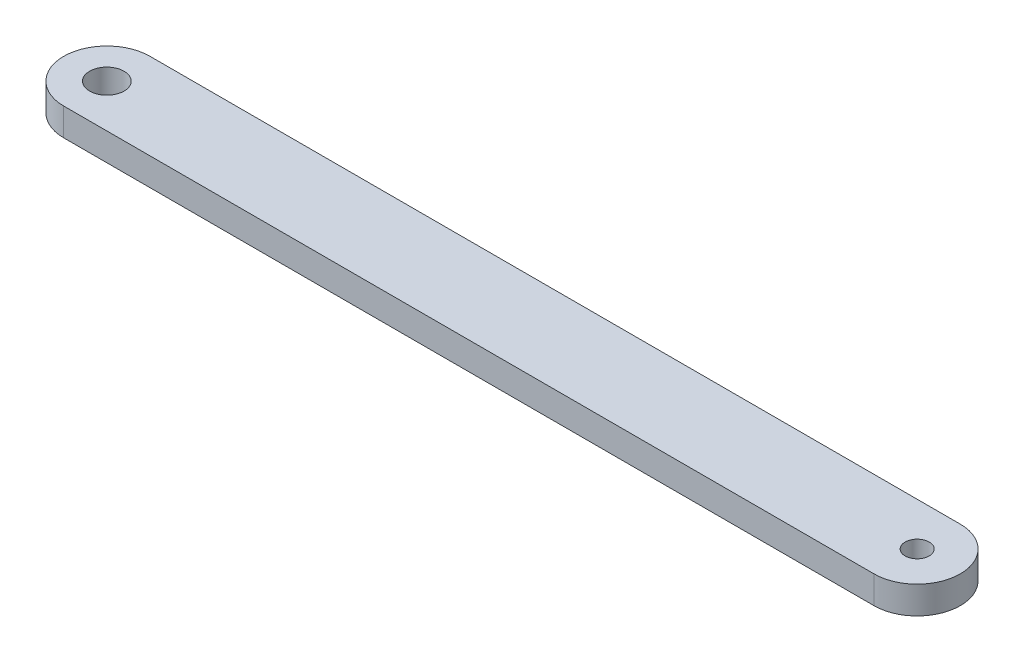
ISO-10303-21;
HEADER;
FILE_DESCRIPTION(('STEP AP214'),'2;1');
FILE_NAME('part.step','',(''),(''),'','','');
FILE_SCHEMA(('AUTOMOTIVE_DESIGN { 1 0 10303 214 1 1 1 1 }'));
ENDSEC;
DATA;
#1=APPLICATION_CONTEXT('core data for automotive mechanical design processes');
#2=APPLICATION_PROTOCOL_DEFINITION('international standard','automotive_design',2000,#1);
#3=PRODUCT_CONTEXT('',#1,'mechanical');
#4=PRODUCT('Part','Part','',(#3));
#5=PRODUCT_RELATED_PRODUCT_CATEGORY('part','',(#4));
#6=PRODUCT_DEFINITION_FORMATION('','',#4);
#7=PRODUCT_DEFINITION_CONTEXT('part definition',#1,'design');
#8=PRODUCT_DEFINITION('design','',#6,#7);
#9=PRODUCT_DEFINITION_SHAPE('','',#8);
#10=(LENGTH_UNIT() NAMED_UNIT(*) SI_UNIT(.MILLI.,.METRE.));
#11=(NAMED_UNIT(*) PLANE_ANGLE_UNIT() SI_UNIT($,.RADIAN.));
#12=(NAMED_UNIT(*) SI_UNIT($,.STERADIAN.) SOLID_ANGLE_UNIT());
#13=UNCERTAINTY_MEASURE_WITH_UNIT(LENGTH_MEASURE(1.E-05),#10,'distance_accuracy_value','');
#14=(GEOMETRIC_REPRESENTATION_CONTEXT(3) GLOBAL_UNCERTAINTY_ASSIGNED_CONTEXT((#13)) GLOBAL_UNIT_ASSIGNED_CONTEXT((#10,
#11,#12)) REPRESENTATION_CONTEXT('',''));
#15=CARTESIAN_POINT('',(0.,0.,0.));
#16=DIRECTION('',(0.,0.,1.));
#17=DIRECTION('',(1.,0.,0.));
#18=AXIS2_PLACEMENT_3D('',#15,#16,#17);
#19=CARTESIAN_POINT('',(0.,1.6,0.));
#20=DIRECTION('',(0.,1.,0.));
#21=DIRECTION('',(0.,0.,1.));
#22=AXIS2_PLACEMENT_3D('',#19,#20,#21);
#23=PLANE('',#22);
#24=CARTESIAN_POINT('',(0.,1.6,0.));
#25=DIRECTION('',(0.,1.,0.));
#26=DIRECTION('',(0.,0.,1.));
#27=AXIS2_PLACEMENT_3D('',#24,#25,#26);
#28=CIRCLE('',#27,1.);
#29=CARTESIAN_POINT('',(0.,1.6,1.));
#30=VERTEX_POINT('',#29);
#31=EDGE_CURVE('E106',#30,#30,#28,.T.);
#32=ORIENTED_EDGE('',*,*,#31,.F.);
#33=EDGE_LOOP('',(#32));
#34=FACE_BOUND('',#33,.T.);
#35=CARTESIAN_POINT('',(0.,1.6,0.));
#36=DIRECTION('',(0.,1.,0.));
#37=DIRECTION('',(0.,0.,1.));
#38=AXIS2_PLACEMENT_3D('',#35,#36,#37);
#39=CIRCLE('',#38,2.5);
#40=CARTESIAN_POINT('',(0.,1.6,-2.5));
#41=VERTEX_POINT('',#40);
#42=CARTESIAN_POINT('',(0.,1.6,2.5));
#43=VERTEX_POINT('',#42);
#44=EDGE_CURVE('E91',#41,#43,#39,.T.);
#45=ORIENTED_EDGE('',*,*,#44,.T.);
#46=DIRECTION('',(1.,0.,0.));
#47=VECTOR('',#46,1.);
#48=CARTESIAN_POINT('',(0.,1.6,2.5));
#49=LINE('',#48,#47);
#50=CARTESIAN_POINT('',(47.,1.6,2.5));
#51=VERTEX_POINT('',#50);
#52=EDGE_CURVE('E86',#43,#51,#49,.T.);
#53=ORIENTED_EDGE('',*,*,#52,.T.);
#54=CARTESIAN_POINT('',(47.,1.6,0.));
#55=DIRECTION('',(0.,1.,0.));
#56=DIRECTION('',(0.,0.,1.));
#57=AXIS2_PLACEMENT_3D('',#54,#55,#56);
#58=CIRCLE('',#57,2.5);
#59=CARTESIAN_POINT('',(47.,1.6,-2.5));
#60=VERTEX_POINT('',#59);
#61=EDGE_CURVE('E89',#51,#60,#58,.T.);
#62=ORIENTED_EDGE('',*,*,#61,.T.);
#63=DIRECTION('',(-1.,0.,0.));
#64=VECTOR('',#63,1.);
#65=CARTESIAN_POINT('',(0.,1.6,-2.5));
#66=LINE('',#65,#64);
#67=EDGE_CURVE('E56',#60,#41,#66,.T.);
#68=ORIENTED_EDGE('',*,*,#67,.T.);
#69=EDGE_LOOP('',(#45,#53,#62,#68));
#70=FACE_BOUND('',#69,.T.);
#71=CARTESIAN_POINT('',(47.,1.6,0.));
#72=DIRECTION('',(0.,1.,0.));
#73=DIRECTION('',(0.,0.,1.));
#74=AXIS2_PLACEMENT_3D('',#71,#72,#73);
#75=CIRCLE('',#74,0.700000000000001);
#76=CARTESIAN_POINT('',(47.,1.6,0.700000000000001));
#77=VERTEX_POINT('',#76);
#78=EDGE_CURVE('E121',#77,#77,#75,.T.);
#79=ORIENTED_EDGE('',*,*,#78,.F.);
#80=EDGE_LOOP('',(#79));
#81=FACE_BOUND('',#80,.T.);
#82=ADVANCED_FACE('F39',(#34,#70,#81),#23,.T.);
#83=CARTESIAN_POINT('',(0.,0.,0.));
#84=DIRECTION('',(0.,1.,0.));
#85=DIRECTION('',(0.,0.,1.));
#86=AXIS2_PLACEMENT_3D('',#83,#84,#85);
#87=PLANE('',#86);
#88=CARTESIAN_POINT('',(0.,0.,0.));
#89=DIRECTION('',(0.,1.,0.));
#90=DIRECTION('',(0.,0.,1.));
#91=AXIS2_PLACEMENT_3D('',#88,#89,#90);
#92=CIRCLE('',#91,2.5);
#93=CARTESIAN_POINT('',(0.,0.,-2.5));
#94=VERTEX_POINT('',#93);
#95=CARTESIAN_POINT('',(0.,0.,2.5));
#96=VERTEX_POINT('',#95);
#97=EDGE_CURVE('E103',#94,#96,#92,.T.);
#98=ORIENTED_EDGE('',*,*,#97,.F.);
#99=DIRECTION('',(-1.,0.,0.));
#100=VECTOR('',#99,1.);
#101=CARTESIAN_POINT('',(0.,0.,-2.5));
#102=LINE('',#101,#100);
#103=CARTESIAN_POINT('',(47.,0.,-2.5));
#104=VERTEX_POINT('',#103);
#105=EDGE_CURVE('E79',#104,#94,#102,.T.);
#106=ORIENTED_EDGE('',*,*,#105,.F.);
#107=CARTESIAN_POINT('',(47.,0.,0.));
#108=DIRECTION('',(0.,1.,0.));
#109=DIRECTION('',(0.,0.,1.));
#110=AXIS2_PLACEMENT_3D('',#107,#108,#109);
#111=CIRCLE('',#110,2.5);
#112=CARTESIAN_POINT('',(47.,0.,2.5));
#113=VERTEX_POINT('',#112);
#114=EDGE_CURVE('E73',#113,#104,#111,.T.);
#115=ORIENTED_EDGE('',*,*,#114,.F.);
#116=DIRECTION('',(1.,0.,0.));
#117=VECTOR('',#116,1.);
#118=CARTESIAN_POINT('',(0.,0.,2.5));
#119=LINE('',#118,#117);
#120=EDGE_CURVE('E95',#96,#113,#119,.T.);
#121=ORIENTED_EDGE('',*,*,#120,.F.);
#122=EDGE_LOOP('',(#98,#106,#115,#121));
#123=FACE_BOUND('',#122,.T.);
#124=CARTESIAN_POINT('',(0.,0.,0.));
#125=DIRECTION('',(0.,1.,0.));
#126=DIRECTION('',(0.,0.,1.));
#127=AXIS2_PLACEMENT_3D('',#124,#125,#126);
#128=CIRCLE('',#127,1.);
#129=CARTESIAN_POINT('',(0.,0.,1.));
#130=VERTEX_POINT('',#129);
#131=EDGE_CURVE('E118',#130,#130,#128,.T.);
#132=ORIENTED_EDGE('',*,*,#131,.T.);
#133=EDGE_LOOP('',(#132));
#134=FACE_BOUND('',#133,.T.);
#135=CARTESIAN_POINT('',(47.,0.,0.));
#136=DIRECTION('',(0.,1.,0.));
#137=DIRECTION('',(0.,0.,1.));
#138=AXIS2_PLACEMENT_3D('',#135,#136,#137);
#139=CIRCLE('',#138,0.700000000000001);
#140=CARTESIAN_POINT('',(47.,0.,0.700000000000001));
#141=VERTEX_POINT('',#140);
#142=EDGE_CURVE('E124',#141,#141,#139,.T.);
#143=ORIENTED_EDGE('',*,*,#142,.T.);
#144=EDGE_LOOP('',(#143));
#145=FACE_BOUND('',#144,.T.);
#146=ADVANCED_FACE('F114',(#123,#134,#145),#87,.F.);
#147=CARTESIAN_POINT('',(0.,1.6,0.));
#148=DIRECTION('',(0.,-1.,0.));
#149=DIRECTION('',(0.,0.,-1.));
#150=AXIS2_PLACEMENT_3D('',#147,#148,#149);
#151=CYLINDRICAL_SURFACE('',#150,2.5);
#152=ORIENTED_EDGE('',*,*,#97,.T.);
#153=DIRECTION('',(0.,-1.,0.));
#154=VECTOR('',#153,1.);
#155=CARTESIAN_POINT('',(0.,1.6,2.5));
#156=LINE('',#155,#154);
#157=EDGE_CURVE('E11',#43,#96,#156,.T.);
#158=ORIENTED_EDGE('',*,*,#157,.F.);
#159=ORIENTED_EDGE('',*,*,#44,.F.);
#160=DIRECTION('',(0.,-1.,0.));
#161=VECTOR('',#160,1.);
#162=CARTESIAN_POINT('',(0.,1.6,-2.5));
#163=LINE('',#162,#161);
#164=EDGE_CURVE('E99',#41,#94,#163,.T.);
#165=ORIENTED_EDGE('',*,*,#164,.T.);
#166=EDGE_LOOP('',(#152,#158,#159,#165));
#167=FACE_BOUND('',#166,.T.);
#168=ADVANCED_FACE('F41',(#167),#151,.T.);
#169=CARTESIAN_POINT('',(0.,1.6,2.5));
#170=DIRECTION('',(0.,0.,-1.));
#171=DIRECTION('',(-1.,0.,0.));
#172=AXIS2_PLACEMENT_3D('',#169,#170,#171);
#173=PLANE('',#172);
#174=ORIENTED_EDGE('',*,*,#120,.T.);
#175=DIRECTION('',(0.,-1.,0.));
#176=VECTOR('',#175,1.);
#177=CARTESIAN_POINT('',(47.,1.6,2.5));
#178=LINE('',#177,#176);
#179=EDGE_CURVE('E48',#51,#113,#178,.T.);
#180=ORIENTED_EDGE('',*,*,#179,.F.);
#181=ORIENTED_EDGE('',*,*,#52,.F.);
#182=ORIENTED_EDGE('',*,*,#157,.T.);
#183=EDGE_LOOP('',(#174,#180,#181,#182));
#184=FACE_BOUND('',#183,.T.);
#185=ADVANCED_FACE('F94',(#184),#173,.F.);
#186=CARTESIAN_POINT('',(47.,1.6,0.));
#187=DIRECTION('',(0.,-1.,0.));
#188=DIRECTION('',(0.,0.,-1.));
#189=AXIS2_PLACEMENT_3D('',#186,#187,#188);
#190=CYLINDRICAL_SURFACE('',#189,2.5);
#191=ORIENTED_EDGE('',*,*,#114,.T.);
#192=DIRECTION('',(0.,-1.,0.));
#193=VECTOR('',#192,1.);
#194=CARTESIAN_POINT('',(47.,1.6,-2.5));
#195=LINE('',#194,#193);
#196=EDGE_CURVE('E96',#60,#104,#195,.T.);
#197=ORIENTED_EDGE('',*,*,#196,.F.);
#198=ORIENTED_EDGE('',*,*,#61,.F.);
#199=ORIENTED_EDGE('',*,*,#179,.T.);
#200=EDGE_LOOP('',(#191,#197,#198,#199));
#201=FACE_BOUND('',#200,.T.);
#202=ADVANCED_FACE('F97',(#201),#190,.T.);
#203=CARTESIAN_POINT('',(0.,1.6,-2.5));
#204=DIRECTION('',(0.,0.,1.));
#205=DIRECTION('',(1.,0.,0.));
#206=AXIS2_PLACEMENT_3D('',#203,#204,#205);
#207=PLANE('',#206);
#208=ORIENTED_EDGE('',*,*,#105,.T.);
#209=ORIENTED_EDGE('',*,*,#164,.F.);
#210=ORIENTED_EDGE('',*,*,#67,.F.);
#211=ORIENTED_EDGE('',*,*,#196,.T.);
#212=EDGE_LOOP('',(#208,#209,#210,#211));
#213=FACE_BOUND('',#212,.T.);
#214=ADVANCED_FACE('F111',(#213),#207,.F.);
#215=CARTESIAN_POINT('',(0.,1.6,0.));
#216=DIRECTION('',(0.,-1.,0.));
#217=DIRECTION('',(0.,0.,-1.));
#218=AXIS2_PLACEMENT_3D('',#215,#216,#217);
#219=CYLINDRICAL_SURFACE('',#218,1.);
#220=ORIENTED_EDGE('',*,*,#31,.T.);
#221=EDGE_LOOP('',(#220));
#222=FACE_BOUND('',#221,.T.);
#223=ORIENTED_EDGE('',*,*,#131,.F.);
#224=EDGE_LOOP('',(#223));
#225=FACE_BOUND('',#224,.T.);
#226=ADVANCED_FACE('F141',(#222,#225),#219,.F.);
#227=CARTESIAN_POINT('',(47.,1.6,0.));
#228=DIRECTION('',(0.,-1.,0.));
#229=DIRECTION('',(0.,0.,-1.));
#230=AXIS2_PLACEMENT_3D('',#227,#228,#229);
#231=CYLINDRICAL_SURFACE('',#230,0.700000000000001);
#232=ORIENTED_EDGE('',*,*,#78,.T.);
#233=EDGE_LOOP('',(#232));
#234=FACE_BOUND('',#233,.T.);
#235=ORIENTED_EDGE('',*,*,#142,.F.);
#236=EDGE_LOOP('',(#235));
#237=FACE_BOUND('',#236,.T.);
#238=ADVANCED_FACE('F130',(#234,#237),#231,.F.);
#239=CLOSED_SHELL('',(#82,#146,#168,#185,#202,#214,#226,#238));
#240=MANIFOLD_SOLID_BREP('B2',#239);
#241=ADVANCED_BREP_SHAPE_REPRESENTATION('',(#18,#240),#14);
#242=SHAPE_DEFINITION_REPRESENTATION(#9,#241);
ENDSEC;
END-ISO-10303-21;
